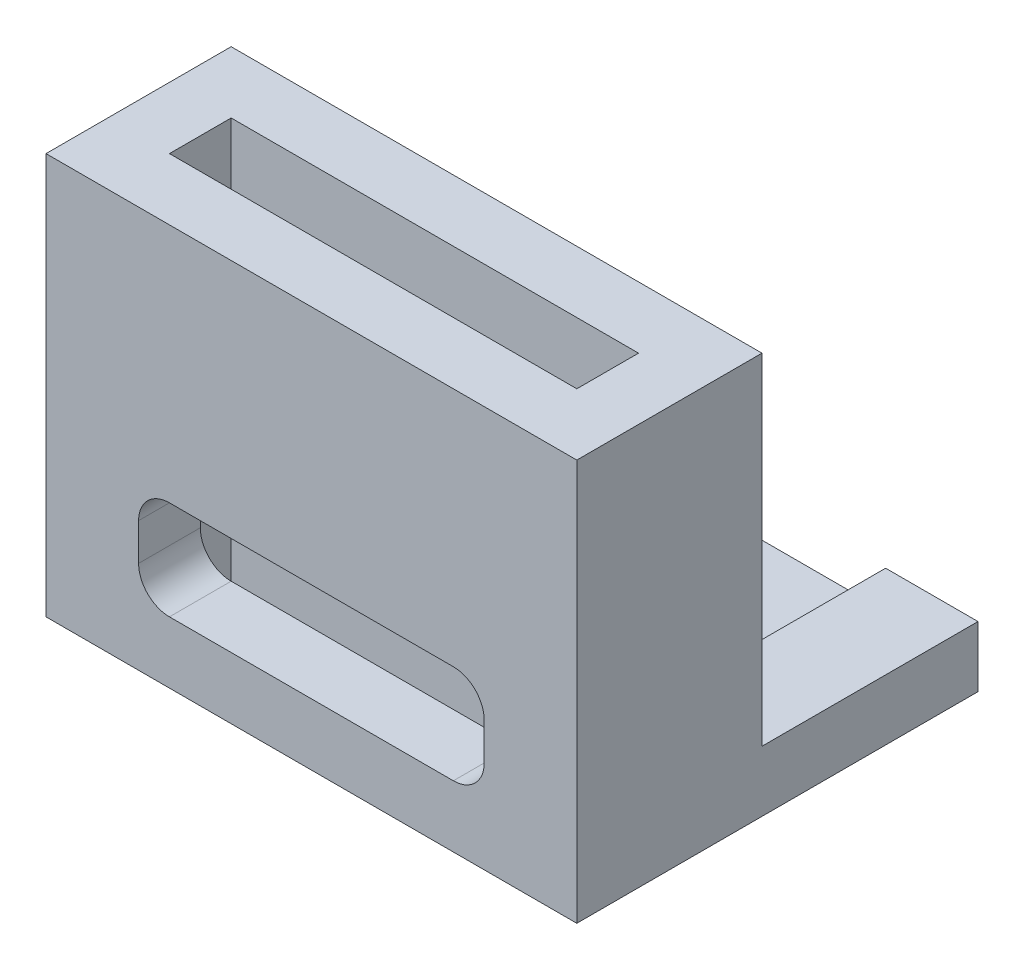
ISO-10303-21;
HEADER;
FILE_DESCRIPTION(('STEP AP214'),'2;1');
FILE_NAME('part.step','',(''),(''),'','','');
FILE_SCHEMA(('AUTOMOTIVE_DESIGN { 1 0 10303 214 1 1 1 1 }'));
ENDSEC;
DATA;
#1=APPLICATION_CONTEXT('core data for automotive mechanical design processes');
#2=APPLICATION_PROTOCOL_DEFINITION('international standard','automotive_design',2000,#1);
#3=PRODUCT_CONTEXT('',#1,'mechanical');
#4=PRODUCT('Part','Part','',(#3));
#5=PRODUCT_RELATED_PRODUCT_CATEGORY('part','',(#4));
#6=PRODUCT_DEFINITION_FORMATION('','',#4);
#7=PRODUCT_DEFINITION_CONTEXT('part definition',#1,'design');
#8=PRODUCT_DEFINITION('design','',#6,#7);
#9=PRODUCT_DEFINITION_SHAPE('','',#8);
#10=(LENGTH_UNIT() NAMED_UNIT(*) SI_UNIT(.MILLI.,.METRE.));
#11=(NAMED_UNIT(*) PLANE_ANGLE_UNIT() SI_UNIT($,.RADIAN.));
#12=(NAMED_UNIT(*) SI_UNIT($,.STERADIAN.) SOLID_ANGLE_UNIT());
#13=UNCERTAINTY_MEASURE_WITH_UNIT(LENGTH_MEASURE(1.E-05),#10,'distance_accuracy_value','');
#14=(GEOMETRIC_REPRESENTATION_CONTEXT(3) GLOBAL_UNCERTAINTY_ASSIGNED_CONTEXT((#13)) GLOBAL_UNIT_ASSIGNED_CONTEXT((#10,
#11,#12)) REPRESENTATION_CONTEXT('',''));
#15=CARTESIAN_POINT('',(0.,0.,0.));
#16=DIRECTION('',(0.,0.,1.));
#17=DIRECTION('',(1.,0.,0.));
#18=AXIS2_PLACEMENT_3D('',#15,#16,#17);
#19=CARTESIAN_POINT('',(15.2,1.96895504732383,-11.));
#20=DIRECTION('',(0.,-1.,0.));
#21=DIRECTION('',(0.,0.,-1.));
#22=AXIS2_PLACEMENT_3D('',#19,#20,#21);
#23=PLANE('',#22);
#24=DIRECTION('',(1.,0.,0.));
#25=VECTOR('',#24,1.);
#26=CARTESIAN_POINT('',(15.2,1.96895504732383,-4.));
#27=LINE('',#26,#25);
#28=CARTESIAN_POINT('',(-2.,1.96895504732383,-4.));
#29=VERTEX_POINT('',#28);
#30=CARTESIAN_POINT('',(1.,1.96895504732383,-4.));
#31=VERTEX_POINT('',#30);
#32=EDGE_CURVE('E55',#29,#31,#27,.T.);
#33=ORIENTED_EDGE('',*,*,#32,.T.);
#34=DIRECTION('',(0.,0.,-1.));
#35=VECTOR('',#34,1.);
#36=CARTESIAN_POINT('',(1.,1.96895504732383,-11.));
#37=LINE('',#36,#35);
#38=CARTESIAN_POINT('',(1.,1.96895504732383,-11.));
#39=VERTEX_POINT('',#38);
#40=EDGE_CURVE('E235',#31,#39,#37,.T.);
#41=ORIENTED_EDGE('',*,*,#40,.T.);
#42=DIRECTION('',(1.,0.,0.));
#43=VECTOR('',#42,1.);
#44=CARTESIAN_POINT('',(15.2,1.96895504732383,-11.));
#45=LINE('',#44,#43);
#46=CARTESIAN_POINT('',(-2.,1.96895504732383,-11.));
#47=VERTEX_POINT('',#46);
#48=EDGE_CURVE('E276',#47,#39,#45,.T.);
#49=ORIENTED_EDGE('',*,*,#48,.F.);
#50=DIRECTION('',(0.,0.,1.));
#51=VECTOR('',#50,1.);
#52=CARTESIAN_POINT('',(-2.,1.96895504732383,-11.));
#53=LINE('',#52,#51);
#54=EDGE_CURVE('E283',#47,#29,#53,.T.);
#55=ORIENTED_EDGE('',*,*,#54,.T.);
#56=EDGE_LOOP('',(#33,#41,#49,#55));
#57=FACE_BOUND('',#56,.T.);
#58=ADVANCED_FACE('F33',(#57),#23,.F.);
#59=CARTESIAN_POINT('',(-2.,13.,-4.));
#60=DIRECTION('',(0.,0.,1.));
#61=DIRECTION('',(1.,0.,0.));
#62=AXIS2_PLACEMENT_3D('',#59,#60,#61);
#63=PLANE('',#62);
#64=DIRECTION('',(0.,1.,0.));
#65=VECTOR('',#64,1.);
#66=CARTESIAN_POINT('',(1.,0.752448814893286,-4.));
#67=LINE('',#66,#65);
#68=CARTESIAN_POINT('',(1.,0.752448814893286,-4.));
#69=VERTEX_POINT('',#68);
#70=EDGE_CURVE('E229',#69,#31,#67,.T.);
#71=ORIENTED_EDGE('',*,*,#70,.T.);
#72=ORIENTED_EDGE('',*,*,#32,.F.);
#73=DIRECTION('',(0.,-1.,0.));
#74=VECTOR('',#73,1.);
#75=CARTESIAN_POINT('',(-2.,13.,-4.));
#76=LINE('',#75,#74);
#77=CARTESIAN_POINT('',(-2.,13.,-4.));
#78=VERTEX_POINT('',#77);
#79=EDGE_CURVE('E428',#78,#29,#76,.T.);
#80=ORIENTED_EDGE('',*,*,#79,.F.);
#81=DIRECTION('',(-1.,0.,0.));
#82=VECTOR('',#81,1.);
#83=CARTESIAN_POINT('',(-2.,13.,-4.));
#84=LINE('',#83,#82);
#85=CARTESIAN_POINT('',(15.2,13.,-4.));
#86=VERTEX_POINT('',#85);
#87=EDGE_CURVE('E405',#86,#78,#84,.T.);
#88=ORIENTED_EDGE('',*,*,#87,.F.);
#89=DIRECTION('',(0.,-1.,0.));
#90=VECTOR('',#89,1.);
#91=CARTESIAN_POINT('',(15.2,13.,-4.));
#92=LINE('',#91,#90);
#93=CARTESIAN_POINT('',(15.2,1.96895504732383,-4.));
#94=VERTEX_POINT('',#93);
#95=EDGE_CURVE('E415',#86,#94,#92,.T.);
#96=ORIENTED_EDGE('',*,*,#95,.T.);
#97=CARTESIAN_POINT('',(12.2065069842452,1.96895504732383,-4.));
#98=VERTEX_POINT('',#97);
#99=EDGE_CURVE('E266',#98,#94,#27,.T.);
#100=ORIENTED_EDGE('',*,*,#99,.F.);
#101=DIRECTION('',(0.,-1.,0.));
#102=VECTOR('',#101,1.);
#103=CARTESIAN_POINT('',(12.2065069842452,0.752448814893286,-4.));
#104=LINE('',#103,#102);
#105=CARTESIAN_POINT('',(12.2065069842452,0.752448814893286,-4.));
#106=VERTEX_POINT('',#105);
#107=EDGE_CURVE('E237',#98,#106,#104,.T.);
#108=ORIENTED_EDGE('',*,*,#107,.T.);
#109=DIRECTION('',(-1.,0.,0.));
#110=VECTOR('',#109,1.);
#111=CARTESIAN_POINT('',(12.2065069842452,0.752448814893286,-4.));
#112=LINE('',#111,#110);
#113=EDGE_CURVE('E244',#106,#69,#112,.T.);
#114=ORIENTED_EDGE('',*,*,#113,.T.);
#115=EDGE_LOOP('',(#71,#72,#80,#88,#96,#100,#108,#114));
#116=FACE_BOUND('',#115,.T.);
#117=DIRECTION('',(0.,1.,0.));
#118=VECTOR('',#117,1.);
#119=CARTESIAN_POINT('',(12.2,13.,-4.));
#120=LINE('',#119,#118);
#121=CARTESIAN_POINT('',(12.2,3.,-4.));
#122=VERTEX_POINT('',#121);
#123=CARTESIAN_POINT('',(12.2,4.2,-4.));
#124=VERTEX_POINT('',#123);
#125=EDGE_CURVE('E356',#122,#124,#120,.T.);
#126=ORIENTED_EDGE('',*,*,#125,.T.);
#127=CARTESIAN_POINT('',(11.2,4.2,-4.));
#128=DIRECTION('',(0.,0.,1.));
#129=DIRECTION('',(1.,0.,0.));
#130=AXIS2_PLACEMENT_3D('',#127,#128,#129);
#131=CIRCLE('',#130,1.);
#132=CARTESIAN_POINT('',(11.2,5.2,-4.));
#133=VERTEX_POINT('',#132);
#134=EDGE_CURVE('E360',#124,#133,#131,.T.);
#135=ORIENTED_EDGE('',*,*,#134,.T.);
#136=DIRECTION('',(1.,0.,0.));
#137=VECTOR('',#136,1.);
#138=CARTESIAN_POINT('',(-2.,5.2,-4.));
#139=LINE('',#138,#137);
#140=CARTESIAN_POINT('',(2.,5.2,-4.));
#141=VERTEX_POINT('',#140);
#142=EDGE_CURVE('E366',#141,#133,#139,.T.);
#143=ORIENTED_EDGE('',*,*,#142,.F.);
#144=CARTESIAN_POINT('',(2.,4.2,-4.));
#145=DIRECTION('',(0.,0.,1.));
#146=DIRECTION('',(1.,0.,0.));
#147=AXIS2_PLACEMENT_3D('',#144,#145,#146);
#148=CIRCLE('',#147,1.);
#149=CARTESIAN_POINT('',(1.,4.2,-4.));
#150=VERTEX_POINT('',#149);
#151=EDGE_CURVE('E370',#141,#150,#148,.T.);
#152=ORIENTED_EDGE('',*,*,#151,.T.);
#153=DIRECTION('',(0.,-1.,0.));
#154=VECTOR('',#153,1.);
#155=CARTESIAN_POINT('',(1.,13.,-4.));
#156=LINE('',#155,#154);
#157=CARTESIAN_POINT('',(1.,3.,-4.));
#158=VERTEX_POINT('',#157);
#159=EDGE_CURVE('E336',#150,#158,#156,.T.);
#160=ORIENTED_EDGE('',*,*,#159,.T.);
#161=CARTESIAN_POINT('',(2.,3.,-4.));
#162=DIRECTION('',(0.,0.,1.));
#163=DIRECTION('',(1.,0.,0.));
#164=AXIS2_PLACEMENT_3D('',#161,#162,#163);
#165=CIRCLE('',#164,1.);
#166=CARTESIAN_POINT('',(2.,2.,-4.));
#167=VERTEX_POINT('',#166);
#168=EDGE_CURVE('E341',#158,#167,#165,.T.);
#169=ORIENTED_EDGE('',*,*,#168,.T.);
#170=DIRECTION('',(1.,0.,0.));
#171=VECTOR('',#170,1.);
#172=CARTESIAN_POINT('',(-2.,2.,-4.));
#173=LINE('',#172,#171);
#174=CARTESIAN_POINT('',(11.2,2.,-4.));
#175=VERTEX_POINT('',#174);
#176=EDGE_CURVE('E346',#167,#175,#173,.T.);
#177=ORIENTED_EDGE('',*,*,#176,.T.);
#178=CARTESIAN_POINT('',(11.2,3.,-4.));
#179=DIRECTION('',(0.,0.,1.));
#180=DIRECTION('',(1.,0.,0.));
#181=AXIS2_PLACEMENT_3D('',#178,#179,#180);
#182=CIRCLE('',#181,1.);
#183=EDGE_CURVE('E351',#175,#122,#182,.T.);
#184=ORIENTED_EDGE('',*,*,#183,.T.);
#185=EDGE_LOOP('',(#126,#135,#143,#152,#160,#169,#177,#184));
#186=FACE_BOUND('',#185,.T.);
#187=ADVANCED_FACE('F35',(#116,#186),#63,.F.);
#188=CARTESIAN_POINT('',(0.,13.,0.));
#189=DIRECTION('',(0.,-1.,0.));
#190=DIRECTION('',(0.,0.,-1.));
#191=AXIS2_PLACEMENT_3D('',#188,#189,#190);
#192=PLANE('',#191);
#193=ORIENTED_EDGE('',*,*,#87,.T.);
#194=DIRECTION('',(0.,0.,1.));
#195=VECTOR('',#194,1.);
#196=CARTESIAN_POINT('',(-2.,13.,2.));
#197=LINE('',#196,#195);
#198=CARTESIAN_POINT('',(-2.,13.,2.));
#199=VERTEX_POINT('',#198);
#200=EDGE_CURVE('E408',#78,#199,#197,.T.);
#201=ORIENTED_EDGE('',*,*,#200,.T.);
#202=DIRECTION('',(1.,0.,0.));
#203=VECTOR('',#202,1.);
#204=CARTESIAN_POINT('',(-2.,13.,2.));
#205=LINE('',#204,#203);
#206=CARTESIAN_POINT('',(15.2,13.,2.));
#207=VERTEX_POINT('',#206);
#208=EDGE_CURVE('E411',#199,#207,#205,.T.);
#209=ORIENTED_EDGE('',*,*,#208,.T.);
#210=DIRECTION('',(0.,0.,-1.));
#211=VECTOR('',#210,1.);
#212=CARTESIAN_POINT('',(15.2,13.,-4.));
#213=LINE('',#212,#211);
#214=EDGE_CURVE('E413',#207,#86,#213,.T.);
#215=ORIENTED_EDGE('',*,*,#214,.T.);
#216=EDGE_LOOP('',(#193,#201,#209,#215));
#217=FACE_BOUND('',#216,.T.);
#218=DIRECTION('',(0.,0.,1.));
#219=VECTOR('',#218,1.);
#220=CARTESIAN_POINT('',(0.,13.,0.));
#221=LINE('',#220,#219);
#222=CARTESIAN_POINT('',(0.,13.,-2.));
#223=VERTEX_POINT('',#222);
#224=CARTESIAN_POINT('',(0.,13.,0.));
#225=VERTEX_POINT('',#224);
#226=EDGE_CURVE('E374',#223,#225,#221,.T.);
#227=ORIENTED_EDGE('',*,*,#226,.F.);
#228=DIRECTION('',(-1.,0.,0.));
#229=VECTOR('',#228,1.);
#230=CARTESIAN_POINT('',(0.,13.,-2.));
#231=LINE('',#230,#229);
#232=CARTESIAN_POINT('',(13.2,13.,-2.));
#233=VERTEX_POINT('',#232);
#234=EDGE_CURVE('E382',#233,#223,#231,.T.);
#235=ORIENTED_EDGE('',*,*,#234,.F.);
#236=DIRECTION('',(0.,0.,-1.));
#237=VECTOR('',#236,1.);
#238=CARTESIAN_POINT('',(13.2,13.,-2.));
#239=LINE('',#238,#237);
#240=CARTESIAN_POINT('',(13.2,13.,0.));
#241=VERTEX_POINT('',#240);
#242=EDGE_CURVE('E379',#241,#233,#239,.T.);
#243=ORIENTED_EDGE('',*,*,#242,.F.);
#244=DIRECTION('',(1.,0.,0.));
#245=VECTOR('',#244,1.);
#246=CARTESIAN_POINT('',(0.,13.,0.));
#247=LINE('',#246,#245);
#248=EDGE_CURVE('E376',#225,#241,#247,.T.);
#249=ORIENTED_EDGE('',*,*,#248,.F.);
#250=EDGE_LOOP('',(#227,#235,#243,#249));
#251=FACE_BOUND('',#250,.T.);
#252=ADVANCED_FACE('F467',(#217,#251),#192,.F.);
#253=CARTESIAN_POINT('',(0.,0.,0.));
#254=DIRECTION('',(0.,-1.,0.));
#255=DIRECTION('',(0.,0.,-1.));
#256=AXIS2_PLACEMENT_3D('',#253,#254,#255);
#257=PLANE('',#256);
#258=CARTESIAN_POINT('',(6.6,0.,-7.5));
#259=DIRECTION('',(0.,-1.,0.));
#260=DIRECTION('',(0.,0.,-1.));
#261=AXIS2_PLACEMENT_3D('',#258,#259,#260);
#262=CIRCLE('',#261,1.6);
#263=CARTESIAN_POINT('',(6.6,0.,-9.1));
#264=VERTEX_POINT('',#263);
#265=EDGE_CURVE('E263',#264,#264,#262,.T.);
#266=ORIENTED_EDGE('',*,*,#265,.F.);
#267=EDGE_LOOP('',(#266));
#268=FACE_BOUND('',#267,.T.);
#269=DIRECTION('',(0.,0.,1.));
#270=VECTOR('',#269,1.);
#271=CARTESIAN_POINT('',(-2.,0.,2.));
#272=LINE('',#271,#270);
#273=CARTESIAN_POINT('',(-2.,0.,-11.));
#274=VERTEX_POINT('',#273);
#275=CARTESIAN_POINT('',(-2.,0.,2.));
#276=VERTEX_POINT('',#275);
#277=EDGE_CURVE('E404',#274,#276,#272,.T.);
#278=ORIENTED_EDGE('',*,*,#277,.F.);
#279=DIRECTION('',(-1.,0.,0.));
#280=VECTOR('',#279,1.);
#281=CARTESIAN_POINT('',(15.2,0.,-11.));
#282=LINE('',#281,#280);
#283=CARTESIAN_POINT('',(15.2,0.,-11.));
#284=VERTEX_POINT('',#283);
#285=EDGE_CURVE('E270',#284,#274,#282,.T.);
#286=ORIENTED_EDGE('',*,*,#285,.F.);
#287=DIRECTION('',(0.,0.,-1.));
#288=VECTOR('',#287,1.);
#289=CARTESIAN_POINT('',(15.2,0.,-4.));
#290=LINE('',#289,#288);
#291=CARTESIAN_POINT('',(15.2,0.,2.));
#292=VERTEX_POINT('',#291);
#293=EDGE_CURVE('E409',#292,#284,#290,.T.);
#294=ORIENTED_EDGE('',*,*,#293,.F.);
#295=DIRECTION('',(1.,0.,0.));
#296=VECTOR('',#295,1.);
#297=CARTESIAN_POINT('',(-2.,0.,2.));
#298=LINE('',#297,#296);
#299=EDGE_CURVE('E417',#276,#292,#298,.T.);
#300=ORIENTED_EDGE('',*,*,#299,.F.);
#301=EDGE_LOOP('',(#278,#286,#294,#300));
#302=FACE_BOUND('',#301,.T.);
#303=DIRECTION('',(-1.,0.,0.));
#304=VECTOR('',#303,1.);
#305=CARTESIAN_POINT('',(0.,0.,-2.));
#306=LINE('',#305,#304);
#307=CARTESIAN_POINT('',(13.2,0.,-2.));
#308=VERTEX_POINT('',#307);
#309=CARTESIAN_POINT('',(0.,0.,-2.));
#310=VERTEX_POINT('',#309);
#311=EDGE_CURVE('E377',#308,#310,#306,.T.);
#312=ORIENTED_EDGE('',*,*,#311,.T.);
#313=DIRECTION('',(0.,0.,1.));
#314=VECTOR('',#313,1.);
#315=CARTESIAN_POINT('',(0.,0.,0.));
#316=LINE('',#315,#314);
#317=CARTESIAN_POINT('',(0.,0.,0.));
#318=VERTEX_POINT('',#317);
#319=EDGE_CURVE('E373',#310,#318,#316,.T.);
#320=ORIENTED_EDGE('',*,*,#319,.T.);
#321=DIRECTION('',(1.,0.,0.));
#322=VECTOR('',#321,1.);
#323=CARTESIAN_POINT('',(0.,0.,0.));
#324=LINE('',#323,#322);
#325=CARTESIAN_POINT('',(13.2,0.,0.));
#326=VERTEX_POINT('',#325);
#327=EDGE_CURVE('E387',#318,#326,#324,.T.);
#328=ORIENTED_EDGE('',*,*,#327,.T.);
#329=DIRECTION('',(0.,0.,-1.));
#330=VECTOR('',#329,1.);
#331=CARTESIAN_POINT('',(13.2,0.,-2.));
#332=LINE('',#331,#330);
#333=EDGE_CURVE('E390',#326,#308,#332,.T.);
#334=ORIENTED_EDGE('',*,*,#333,.T.);
#335=EDGE_LOOP('',(#312,#320,#328,#334));
#336=FACE_BOUND('',#335,.T.);
#337=ADVANCED_FACE('F505',(#268,#302,#336),#257,.T.);
#338=CARTESIAN_POINT('',(-2.,13.,2.));
#339=DIRECTION('',(1.,0.,0.));
#340=DIRECTION('',(0.,0.,-1.));
#341=AXIS2_PLACEMENT_3D('',#338,#339,#340);
#342=PLANE('',#341);
#343=ORIENTED_EDGE('',*,*,#277,.T.);
#344=DIRECTION('',(0.,-1.,0.));
#345=VECTOR('',#344,1.);
#346=CARTESIAN_POINT('',(-2.,13.,2.));
#347=LINE('',#346,#345);
#348=EDGE_CURVE('E425',#199,#276,#347,.T.);
#349=ORIENTED_EDGE('',*,*,#348,.F.);
#350=ORIENTED_EDGE('',*,*,#200,.F.);
#351=ORIENTED_EDGE('',*,*,#79,.T.);
#352=ORIENTED_EDGE('',*,*,#54,.F.);
#353=DIRECTION('',(0.,1.,0.));
#354=VECTOR('',#353,1.);
#355=CARTESIAN_POINT('',(-2.,0.,-11.));
#356=LINE('',#355,#354);
#357=EDGE_CURVE('E273',#274,#47,#356,.T.);
#358=ORIENTED_EDGE('',*,*,#357,.F.);
#359=EDGE_LOOP('',(#343,#349,#350,#351,#352,#358));
#360=FACE_BOUND('',#359,.T.);
#361=ADVANCED_FACE('F490',(#360),#342,.F.);
#362=CARTESIAN_POINT('',(-2.,13.,2.));
#363=DIRECTION('',(0.,0.,-1.));
#364=DIRECTION('',(-1.,0.,0.));
#365=AXIS2_PLACEMENT_3D('',#362,#363,#364);
#366=PLANE('',#365);
#367=DIRECTION('',(0.,-1.,0.));
#368=VECTOR('',#367,1.);
#369=CARTESIAN_POINT('',(1.,4.2,2.));
#370=LINE('',#369,#368);
#371=CARTESIAN_POINT('',(1.,4.2,2.));
#372=VERTEX_POINT('',#371);
#373=CARTESIAN_POINT('',(1.,3.,2.));
#374=VERTEX_POINT('',#373);
#375=EDGE_CURVE('E288',#372,#374,#370,.T.);
#376=ORIENTED_EDGE('',*,*,#375,.F.);
#377=CARTESIAN_POINT('',(2.,4.2,2.));
#378=DIRECTION('',(0.,0.,1.));
#379=DIRECTION('',(1.,0.,0.));
#380=AXIS2_PLACEMENT_3D('',#377,#378,#379);
#381=CIRCLE('',#380,1.);
#382=CARTESIAN_POINT('',(2.,5.2,2.));
#383=VERTEX_POINT('',#382);
#384=EDGE_CURVE('E286',#383,#372,#381,.T.);
#385=ORIENTED_EDGE('',*,*,#384,.F.);
#386=DIRECTION('',(1.,0.,0.));
#387=VECTOR('',#386,1.);
#388=CARTESIAN_POINT('',(2.,5.2,2.));
#389=LINE('',#388,#387);
#390=CARTESIAN_POINT('',(11.2,5.2,2.));
#391=VERTEX_POINT('',#390);
#392=EDGE_CURVE('E306',#383,#391,#389,.T.);
#393=ORIENTED_EDGE('',*,*,#392,.T.);
#394=CARTESIAN_POINT('',(11.2,4.2,2.));
#395=DIRECTION('',(0.,0.,1.));
#396=DIRECTION('',(1.,0.,0.));
#397=AXIS2_PLACEMENT_3D('',#394,#395,#396);
#398=CIRCLE('',#397,1.);
#399=CARTESIAN_POINT('',(12.2,4.2,2.));
#400=VERTEX_POINT('',#399);
#401=EDGE_CURVE('E303',#400,#391,#398,.T.);
#402=ORIENTED_EDGE('',*,*,#401,.F.);
#403=DIRECTION('',(0.,1.,0.));
#404=VECTOR('',#403,1.);
#405=CARTESIAN_POINT('',(12.2,3.,2.));
#406=LINE('',#405,#404);
#407=CARTESIAN_POINT('',(12.2,3.,2.));
#408=VERTEX_POINT('',#407);
#409=EDGE_CURVE('E300',#408,#400,#406,.T.);
#410=ORIENTED_EDGE('',*,*,#409,.F.);
#411=CARTESIAN_POINT('',(11.2,3.,2.));
#412=DIRECTION('',(0.,0.,1.));
#413=DIRECTION('',(1.,0.,0.));
#414=AXIS2_PLACEMENT_3D('',#411,#412,#413);
#415=CIRCLE('',#414,1.);
#416=CARTESIAN_POINT('',(11.2,2.,2.));
#417=VERTEX_POINT('',#416);
#418=EDGE_CURVE('E297',#417,#408,#415,.T.);
#419=ORIENTED_EDGE('',*,*,#418,.F.);
#420=DIRECTION('',(1.,0.,0.));
#421=VECTOR('',#420,1.);
#422=CARTESIAN_POINT('',(2.,2.,2.));
#423=LINE('',#422,#421);
#424=CARTESIAN_POINT('',(2.,2.,2.));
#425=VERTEX_POINT('',#424);
#426=EDGE_CURVE('E294',#425,#417,#423,.T.);
#427=ORIENTED_EDGE('',*,*,#426,.F.);
#428=CARTESIAN_POINT('',(2.,3.,2.));
#429=DIRECTION('',(0.,0.,1.));
#430=DIRECTION('',(1.,0.,0.));
#431=AXIS2_PLACEMENT_3D('',#428,#429,#430);
#432=CIRCLE('',#431,1.);
#433=EDGE_CURVE('E291',#374,#425,#432,.T.);
#434=ORIENTED_EDGE('',*,*,#433,.F.);
#435=EDGE_LOOP('',(#376,#385,#393,#402,#410,#419,#427,#434));
#436=FACE_BOUND('',#435,.T.);
#437=ORIENTED_EDGE('',*,*,#299,.T.);
#438=DIRECTION('',(0.,-1.,0.));
#439=VECTOR('',#438,1.);
#440=CARTESIAN_POINT('',(15.2,13.,2.));
#441=LINE('',#440,#439);
#442=EDGE_CURVE('E422',#207,#292,#441,.T.);
#443=ORIENTED_EDGE('',*,*,#442,.F.);
#444=ORIENTED_EDGE('',*,*,#208,.F.);
#445=ORIENTED_EDGE('',*,*,#348,.T.);
#446=EDGE_LOOP('',(#437,#443,#444,#445));
#447=FACE_BOUND('',#446,.T.);
#448=ADVANCED_FACE('F508',(#436,#447),#366,.F.);
#449=CARTESIAN_POINT('',(15.2,13.,-4.));
#450=DIRECTION('',(-1.,0.,0.));
#451=DIRECTION('',(0.,0.,1.));
#452=AXIS2_PLACEMENT_3D('',#449,#450,#451);
#453=PLANE('',#452);
#454=ORIENTED_EDGE('',*,*,#293,.T.);
#455=DIRECTION('',(0.,-1.,0.));
#456=VECTOR('',#455,1.);
#457=CARTESIAN_POINT('',(15.2,0.,-11.));
#458=LINE('',#457,#456);
#459=CARTESIAN_POINT('',(15.2,1.96895504732383,-11.));
#460=VERTEX_POINT('',#459);
#461=EDGE_CURVE('E267',#460,#284,#458,.T.);
#462=ORIENTED_EDGE('',*,*,#461,.F.);
#463=DIRECTION('',(0.,0.,1.));
#464=VECTOR('',#463,1.);
#465=CARTESIAN_POINT('',(15.2,1.96895504732383,-11.));
#466=LINE('',#465,#464);
#467=EDGE_CURVE('E279',#460,#94,#466,.T.);
#468=ORIENTED_EDGE('',*,*,#467,.T.);
#469=ORIENTED_EDGE('',*,*,#95,.F.);
#470=ORIENTED_EDGE('',*,*,#214,.F.);
#471=ORIENTED_EDGE('',*,*,#442,.T.);
#472=EDGE_LOOP('',(#454,#462,#468,#469,#470,#471));
#473=FACE_BOUND('',#472,.T.);
#474=ADVANCED_FACE('F500',(#473),#453,.F.);
#475=CARTESIAN_POINT('',(0.,13.,0.));
#476=DIRECTION('',(1.,0.,0.));
#477=DIRECTION('',(0.,0.,-1.));
#478=AXIS2_PLACEMENT_3D('',#475,#476,#477);
#479=PLANE('',#478);
#480=ORIENTED_EDGE('',*,*,#319,.F.);
#481=DIRECTION('',(0.,-1.,0.));
#482=VECTOR('',#481,1.);
#483=CARTESIAN_POINT('',(0.,13.,-2.));
#484=LINE('',#483,#482);
#485=EDGE_CURVE('E384',#223,#310,#484,.T.);
#486=ORIENTED_EDGE('',*,*,#485,.F.);
#487=ORIENTED_EDGE('',*,*,#226,.T.);
#488=DIRECTION('',(0.,-1.,0.));
#489=VECTOR('',#488,1.);
#490=CARTESIAN_POINT('',(0.,13.,0.));
#491=LINE('',#490,#489);
#492=EDGE_CURVE('E401',#225,#318,#491,.T.);
#493=ORIENTED_EDGE('',*,*,#492,.T.);
#494=EDGE_LOOP('',(#480,#486,#487,#493));
#495=FACE_BOUND('',#494,.T.);
#496=ADVANCED_FACE('F516',(#495),#479,.T.);
#497=CARTESIAN_POINT('',(0.,13.,0.));
#498=DIRECTION('',(0.,0.,-1.));
#499=DIRECTION('',(-1.,0.,0.));
#500=AXIS2_PLACEMENT_3D('',#497,#498,#499);
#501=PLANE('',#500);
#502=CARTESIAN_POINT('',(2.,4.2,0.));
#503=DIRECTION('',(0.,0.,-1.));
#504=DIRECTION('',(-1.,0.,0.));
#505=AXIS2_PLACEMENT_3D('',#502,#503,#504);
#506=CIRCLE('',#505,1.);
#507=CARTESIAN_POINT('',(1.,4.2,0.));
#508=VERTEX_POINT('',#507);
#509=CARTESIAN_POINT('',(2.,5.2,0.));
#510=VERTEX_POINT('',#509);
#511=EDGE_CURVE('E368',#508,#510,#506,.T.);
#512=ORIENTED_EDGE('',*,*,#511,.F.);
#513=DIRECTION('',(0.,1.,0.));
#514=VECTOR('',#513,1.);
#515=CARTESIAN_POINT('',(1.,13.,0.));
#516=LINE('',#515,#514);
#517=CARTESIAN_POINT('',(1.,3.,0.));
#518=VERTEX_POINT('',#517);
#519=EDGE_CURVE('E334',#518,#508,#516,.T.);
#520=ORIENTED_EDGE('',*,*,#519,.F.);
#521=CARTESIAN_POINT('',(2.,3.,0.));
#522=DIRECTION('',(0.,0.,-1.));
#523=DIRECTION('',(-1.,0.,0.));
#524=AXIS2_PLACEMENT_3D('',#521,#522,#523);
#525=CIRCLE('',#524,1.);
#526=CARTESIAN_POINT('',(2.,2.,0.));
#527=VERTEX_POINT('',#526);
#528=EDGE_CURVE('E338',#527,#518,#525,.T.);
#529=ORIENTED_EDGE('',*,*,#528,.F.);
#530=DIRECTION('',(-1.,0.,0.));
#531=VECTOR('',#530,1.);
#532=CARTESIAN_POINT('',(0.,2.,0.));
#533=LINE('',#532,#531);
#534=CARTESIAN_POINT('',(11.2,2.,0.));
#535=VERTEX_POINT('',#534);
#536=EDGE_CURVE('E344',#535,#527,#533,.T.);
#537=ORIENTED_EDGE('',*,*,#536,.F.);
#538=CARTESIAN_POINT('',(11.2,3.,0.));
#539=DIRECTION('',(0.,0.,-1.));
#540=DIRECTION('',(-1.,0.,0.));
#541=AXIS2_PLACEMENT_3D('',#538,#539,#540);
#542=CIRCLE('',#541,1.);
#543=CARTESIAN_POINT('',(12.2,3.,0.));
#544=VERTEX_POINT('',#543);
#545=EDGE_CURVE('E349',#544,#535,#542,.T.);
#546=ORIENTED_EDGE('',*,*,#545,.F.);
#547=DIRECTION('',(0.,-1.,0.));
#548=VECTOR('',#547,1.);
#549=CARTESIAN_POINT('',(12.2,13.,0.));
#550=LINE('',#549,#548);
#551=CARTESIAN_POINT('',(12.2,4.2,0.));
#552=VERTEX_POINT('',#551);
#553=EDGE_CURVE('E354',#552,#544,#550,.T.);
#554=ORIENTED_EDGE('',*,*,#553,.F.);
#555=CARTESIAN_POINT('',(11.2,4.2,0.));
#556=DIRECTION('',(0.,0.,-1.));
#557=DIRECTION('',(-1.,0.,0.));
#558=AXIS2_PLACEMENT_3D('',#555,#556,#557);
#559=CIRCLE('',#558,1.);
#560=CARTESIAN_POINT('',(11.2,5.2,0.));
#561=VERTEX_POINT('',#560);
#562=EDGE_CURVE('E358',#561,#552,#559,.T.);
#563=ORIENTED_EDGE('',*,*,#562,.F.);
#564=DIRECTION('',(-1.,0.,0.));
#565=VECTOR('',#564,1.);
#566=CARTESIAN_POINT('',(0.,5.2,0.));
#567=LINE('',#566,#565);
#568=EDGE_CURVE('E363',#561,#510,#567,.T.);
#569=ORIENTED_EDGE('',*,*,#568,.T.);
#570=EDGE_LOOP('',(#512,#520,#529,#537,#546,#554,#563,#569));
#571=FACE_BOUND('',#570,.T.);
#572=ORIENTED_EDGE('',*,*,#327,.F.);
#573=ORIENTED_EDGE('',*,*,#492,.F.);
#574=ORIENTED_EDGE('',*,*,#248,.T.);
#575=DIRECTION('',(0.,-1.,0.));
#576=VECTOR('',#575,1.);
#577=CARTESIAN_POINT('',(13.2,13.,0.));
#578=LINE('',#577,#576);
#579=EDGE_CURVE('E399',#241,#326,#578,.T.);
#580=ORIENTED_EDGE('',*,*,#579,.T.);
#581=EDGE_LOOP('',(#572,#573,#574,#580));
#582=FACE_BOUND('',#581,.T.);
#583=ADVANCED_FACE('F527',(#571,#582),#501,.T.);
#584=CARTESIAN_POINT('',(13.2,13.,-2.));
#585=DIRECTION('',(-1.,0.,0.));
#586=DIRECTION('',(0.,0.,1.));
#587=AXIS2_PLACEMENT_3D('',#584,#585,#586);
#588=PLANE('',#587);
#589=ORIENTED_EDGE('',*,*,#333,.F.);
#590=ORIENTED_EDGE('',*,*,#579,.F.);
#591=ORIENTED_EDGE('',*,*,#242,.T.);
#592=DIRECTION('',(0.,-1.,0.));
#593=VECTOR('',#592,1.);
#594=CARTESIAN_POINT('',(13.2,13.,-2.));
#595=LINE('',#594,#593);
#596=EDGE_CURVE('E397',#233,#308,#595,.T.);
#597=ORIENTED_EDGE('',*,*,#596,.T.);
#598=EDGE_LOOP('',(#589,#590,#591,#597));
#599=FACE_BOUND('',#598,.T.);
#600=ADVANCED_FACE('F531',(#599),#588,.T.);
#601=CARTESIAN_POINT('',(0.,13.,-2.));
#602=DIRECTION('',(0.,0.,1.));
#603=DIRECTION('',(1.,0.,0.));
#604=AXIS2_PLACEMENT_3D('',#601,#602,#603);
#605=PLANE('',#604);
#606=CARTESIAN_POINT('',(2.,4.2,-2.));
#607=DIRECTION('',(0.,0.,1.));
#608=DIRECTION('',(1.,0.,0.));
#609=AXIS2_PLACEMENT_3D('',#606,#607,#608);
#610=CIRCLE('',#609,1.);
#611=CARTESIAN_POINT('',(2.,5.2,-2.));
#612=VERTEX_POINT('',#611);
#613=CARTESIAN_POINT('',(1.,4.2,-2.));
#614=VERTEX_POINT('',#613);
#615=EDGE_CURVE('E41',#612,#614,#610,.T.);
#616=ORIENTED_EDGE('',*,*,#615,.F.);
#617=DIRECTION('',(1.,0.,0.));
#618=VECTOR('',#617,1.);
#619=CARTESIAN_POINT('',(0.,5.2,-2.));
#620=LINE('',#619,#618);
#621=CARTESIAN_POINT('',(11.2,5.2,-2.));
#622=VERTEX_POINT('',#621);
#623=EDGE_CURVE('E442',#612,#622,#620,.T.);
#624=ORIENTED_EDGE('',*,*,#623,.T.);
#625=CARTESIAN_POINT('',(11.2,4.2,-2.));
#626=DIRECTION('',(0.,0.,1.));
#627=DIRECTION('',(1.,0.,0.));
#628=AXIS2_PLACEMENT_3D('',#625,#626,#627);
#629=CIRCLE('',#628,1.);
#630=CARTESIAN_POINT('',(12.2,4.2,-2.));
#631=VERTEX_POINT('',#630);
#632=EDGE_CURVE('E440',#631,#622,#629,.T.);
#633=ORIENTED_EDGE('',*,*,#632,.F.);
#634=DIRECTION('',(0.,1.,0.));
#635=VECTOR('',#634,1.);
#636=CARTESIAN_POINT('',(12.2,13.,-2.));
#637=LINE('',#636,#635);
#638=CARTESIAN_POINT('',(12.2,3.,-2.));
#639=VERTEX_POINT('',#638);
#640=EDGE_CURVE('E438',#639,#631,#637,.T.);
#641=ORIENTED_EDGE('',*,*,#640,.F.);
#642=CARTESIAN_POINT('',(11.2,3.,-2.));
#643=DIRECTION('',(0.,0.,1.));
#644=DIRECTION('',(1.,0.,0.));
#645=AXIS2_PLACEMENT_3D('',#642,#643,#644);
#646=CIRCLE('',#645,1.);
#647=CARTESIAN_POINT('',(11.2,2.,-2.));
#648=VERTEX_POINT('',#647);
#649=EDGE_CURVE('E436',#648,#639,#646,.T.);
#650=ORIENTED_EDGE('',*,*,#649,.F.);
#651=DIRECTION('',(1.,0.,0.));
#652=VECTOR('',#651,1.);
#653=CARTESIAN_POINT('',(0.,2.,-2.));
#654=LINE('',#653,#652);
#655=CARTESIAN_POINT('',(2.,2.,-2.));
#656=VERTEX_POINT('',#655);
#657=EDGE_CURVE('E434',#656,#648,#654,.T.);
#658=ORIENTED_EDGE('',*,*,#657,.F.);
#659=CARTESIAN_POINT('',(2.,3.,-2.));
#660=DIRECTION('',(0.,0.,1.));
#661=DIRECTION('',(1.,0.,0.));
#662=AXIS2_PLACEMENT_3D('',#659,#660,#661);
#663=CIRCLE('',#662,1.);
#664=CARTESIAN_POINT('',(1.,3.,-2.));
#665=VERTEX_POINT('',#664);
#666=EDGE_CURVE('E432',#665,#656,#663,.T.);
#667=ORIENTED_EDGE('',*,*,#666,.F.);
#668=DIRECTION('',(0.,-1.,0.));
#669=VECTOR('',#668,1.);
#670=CARTESIAN_POINT('',(1.,13.,-2.));
#671=LINE('',#670,#669);
#672=EDGE_CURVE('E430',#614,#665,#671,.T.);
#673=ORIENTED_EDGE('',*,*,#672,.F.);
#674=EDGE_LOOP('',(#616,#624,#633,#641,#650,#658,#667,#673));
#675=FACE_BOUND('',#674,.T.);
#676=ORIENTED_EDGE('',*,*,#311,.F.);
#677=ORIENTED_EDGE('',*,*,#596,.F.);
#678=ORIENTED_EDGE('',*,*,#234,.T.);
#679=ORIENTED_EDGE('',*,*,#485,.T.);
#680=EDGE_LOOP('',(#676,#677,#678,#679));
#681=FACE_BOUND('',#680,.T.);
#682=ADVANCED_FACE('F535',(#675,#681),#605,.T.);
#683=CARTESIAN_POINT('',(1.,4.2,-11.));
#684=DIRECTION('',(-1.,0.,0.));
#685=DIRECTION('',(0.,-1.,0.));
#686=AXIS2_PLACEMENT_3D('',#683,#684,#685);
#687=PLANE('',#686);
#688=DIRECTION('',(0.,0.,1.));
#689=VECTOR('',#688,1.);
#690=CARTESIAN_POINT('',(1.,4.2,-11.));
#691=LINE('',#690,#689);
#692=EDGE_CURVE('E331',#150,#614,#691,.T.);
#693=ORIENTED_EDGE('',*,*,#692,.T.);
#694=ORIENTED_EDGE('',*,*,#672,.T.);
#695=DIRECTION('',(0.,0.,1.));
#696=VECTOR('',#695,1.);
#697=CARTESIAN_POINT('',(1.,3.,-11.));
#698=LINE('',#697,#696);
#699=EDGE_CURVE('E328',#158,#665,#698,.T.);
#700=ORIENTED_EDGE('',*,*,#699,.F.);
#701=ORIENTED_EDGE('',*,*,#159,.F.);
#702=EDGE_LOOP('',(#693,#694,#700,#701));
#703=FACE_BOUND('',#702,.T.);
#704=ADVANCED_FACE('F482',(#703),#687,.F.);
#705=CARTESIAN_POINT('',(2.,3.,-11.));
#706=DIRECTION('',(0.,0.,1.));
#707=DIRECTION('',(1.,0.,0.));
#708=AXIS2_PLACEMENT_3D('',#705,#706,#707);
#709=CYLINDRICAL_SURFACE('',#708,1.);
#710=ORIENTED_EDGE('',*,*,#699,.T.);
#711=ORIENTED_EDGE('',*,*,#666,.T.);
#712=DIRECTION('',(0.,0.,1.));
#713=VECTOR('',#712,1.);
#714=CARTESIAN_POINT('',(2.,2.,-11.));
#715=LINE('',#714,#713);
#716=EDGE_CURVE('E325',#167,#656,#715,.T.);
#717=ORIENTED_EDGE('',*,*,#716,.F.);
#718=ORIENTED_EDGE('',*,*,#168,.F.);
#719=EDGE_LOOP('',(#710,#711,#717,#718));
#720=FACE_BOUND('',#719,.T.);
#721=ADVANCED_FACE('F547',(#720),#709,.F.);
#722=CARTESIAN_POINT('',(2.,2.,-11.));
#723=DIRECTION('',(0.,-1.,0.));
#724=DIRECTION('',(0.,0.,-1.));
#725=AXIS2_PLACEMENT_3D('',#722,#723,#724);
#726=PLANE('',#725);
#727=ORIENTED_EDGE('',*,*,#716,.T.);
#728=ORIENTED_EDGE('',*,*,#657,.T.);
#729=DIRECTION('',(0.,0.,1.));
#730=VECTOR('',#729,1.);
#731=CARTESIAN_POINT('',(11.2,2.,-11.));
#732=LINE('',#731,#730);
#733=EDGE_CURVE('E322',#175,#648,#732,.T.);
#734=ORIENTED_EDGE('',*,*,#733,.F.);
#735=ORIENTED_EDGE('',*,*,#176,.F.);
#736=EDGE_LOOP('',(#727,#728,#734,#735));
#737=FACE_BOUND('',#736,.T.);
#738=ADVANCED_FACE('F551',(#737),#726,.F.);
#739=CARTESIAN_POINT('',(11.2,3.,-11.));
#740=DIRECTION('',(0.,0.,1.));
#741=DIRECTION('',(1.,0.,0.));
#742=AXIS2_PLACEMENT_3D('',#739,#740,#741);
#743=CYLINDRICAL_SURFACE('',#742,1.);
#744=ORIENTED_EDGE('',*,*,#733,.T.);
#745=ORIENTED_EDGE('',*,*,#649,.T.);
#746=DIRECTION('',(0.,0.,1.));
#747=VECTOR('',#746,1.);
#748=CARTESIAN_POINT('',(12.2,3.,-11.));
#749=LINE('',#748,#747);
#750=EDGE_CURVE('E319',#122,#639,#749,.T.);
#751=ORIENTED_EDGE('',*,*,#750,.F.);
#752=ORIENTED_EDGE('',*,*,#183,.F.);
#753=EDGE_LOOP('',(#744,#745,#751,#752));
#754=FACE_BOUND('',#753,.T.);
#755=ADVANCED_FACE('F555',(#754),#743,.F.);
#756=CARTESIAN_POINT('',(12.2,3.,-11.));
#757=DIRECTION('',(1.,0.,0.));
#758=DIRECTION('',(0.,0.,-1.));
#759=AXIS2_PLACEMENT_3D('',#756,#757,#758);
#760=PLANE('',#759);
#761=ORIENTED_EDGE('',*,*,#750,.T.);
#762=ORIENTED_EDGE('',*,*,#640,.T.);
#763=DIRECTION('',(0.,0.,1.));
#764=VECTOR('',#763,1.);
#765=CARTESIAN_POINT('',(12.2,4.2,-11.));
#766=LINE('',#765,#764);
#767=EDGE_CURVE('E316',#124,#631,#766,.T.);
#768=ORIENTED_EDGE('',*,*,#767,.F.);
#769=ORIENTED_EDGE('',*,*,#125,.F.);
#770=EDGE_LOOP('',(#761,#762,#768,#769));
#771=FACE_BOUND('',#770,.T.);
#772=ADVANCED_FACE('F560',(#771),#760,.F.);
#773=CARTESIAN_POINT('',(11.2,4.2,-11.));
#774=DIRECTION('',(0.,0.,1.));
#775=DIRECTION('',(1.,0.,0.));
#776=AXIS2_PLACEMENT_3D('',#773,#774,#775);
#777=CYLINDRICAL_SURFACE('',#776,1.);
#778=ORIENTED_EDGE('',*,*,#767,.T.);
#779=ORIENTED_EDGE('',*,*,#632,.T.);
#780=DIRECTION('',(0.,0.,1.));
#781=VECTOR('',#780,1.);
#782=CARTESIAN_POINT('',(11.2,5.2,-11.));
#783=LINE('',#782,#781);
#784=EDGE_CURVE('E313',#133,#622,#783,.T.);
#785=ORIENTED_EDGE('',*,*,#784,.F.);
#786=ORIENTED_EDGE('',*,*,#134,.F.);
#787=EDGE_LOOP('',(#778,#779,#785,#786));
#788=FACE_BOUND('',#787,.T.);
#789=ADVANCED_FACE('F565',(#788),#777,.F.);
#790=CARTESIAN_POINT('',(2.,5.2,-11.));
#791=DIRECTION('',(0.,-1.,0.));
#792=DIRECTION('',(0.,0.,-1.));
#793=AXIS2_PLACEMENT_3D('',#790,#791,#792);
#794=PLANE('',#793);
#795=ORIENTED_EDGE('',*,*,#142,.T.);
#796=ORIENTED_EDGE('',*,*,#784,.T.);
#797=ORIENTED_EDGE('',*,*,#623,.F.);
#798=DIRECTION('',(0.,0.,1.));
#799=VECTOR('',#798,1.);
#800=CARTESIAN_POINT('',(2.,5.2,-11.));
#801=LINE('',#800,#799);
#802=EDGE_CURVE('E312',#141,#612,#801,.T.);
#803=ORIENTED_EDGE('',*,*,#802,.F.);
#804=EDGE_LOOP('',(#795,#796,#797,#803));
#805=FACE_BOUND('',#804,.T.);
#806=ADVANCED_FACE('F543',(#805),#794,.T.);
#807=CARTESIAN_POINT('',(2.,4.2,-11.));
#808=DIRECTION('',(0.,0.,1.));
#809=DIRECTION('',(1.,0.,0.));
#810=AXIS2_PLACEMENT_3D('',#807,#808,#809);
#811=CYLINDRICAL_SURFACE('',#810,1.);
#812=ORIENTED_EDGE('',*,*,#802,.T.);
#813=ORIENTED_EDGE('',*,*,#615,.T.);
#814=ORIENTED_EDGE('',*,*,#692,.F.);
#815=ORIENTED_EDGE('',*,*,#151,.F.);
#816=EDGE_LOOP('',(#812,#813,#814,#815));
#817=FACE_BOUND('',#816,.T.);
#818=ADVANCED_FACE('F540',(#817),#811,.F.);
#819=ORIENTED_EDGE('',*,*,#511,.T.);
#820=EDGE_CURVE('E310',#510,#383,#801,.T.);
#821=ORIENTED_EDGE('',*,*,#820,.T.);
#822=ORIENTED_EDGE('',*,*,#384,.T.);
#823=EDGE_CURVE('E309',#508,#372,#691,.T.);
#824=ORIENTED_EDGE('',*,*,#823,.F.);
#825=EDGE_LOOP('',(#819,#821,#822,#824));
#826=FACE_BOUND('',#825,.T.);
#827=ADVANCED_FACE('F542',(#826),#811,.F.);
#828=EDGE_CURVE('E314',#561,#391,#783,.T.);
#829=ORIENTED_EDGE('',*,*,#828,.T.);
#830=ORIENTED_EDGE('',*,*,#392,.F.);
#831=ORIENTED_EDGE('',*,*,#820,.F.);
#832=ORIENTED_EDGE('',*,*,#568,.F.);
#833=EDGE_LOOP('',(#829,#830,#831,#832));
#834=FACE_BOUND('',#833,.T.);
#835=ADVANCED_FACE('F573',(#834),#794,.T.);
#836=ORIENTED_EDGE('',*,*,#562,.T.);
#837=EDGE_CURVE('E317',#552,#400,#766,.T.);
#838=ORIENTED_EDGE('',*,*,#837,.T.);
#839=ORIENTED_EDGE('',*,*,#401,.T.);
#840=ORIENTED_EDGE('',*,*,#828,.F.);
#841=EDGE_LOOP('',(#836,#838,#839,#840));
#842=FACE_BOUND('',#841,.T.);
#843=ADVANCED_FACE('F570',(#842),#777,.F.);
#844=ORIENTED_EDGE('',*,*,#553,.T.);
#845=EDGE_CURVE('E320',#544,#408,#749,.T.);
#846=ORIENTED_EDGE('',*,*,#845,.T.);
#847=ORIENTED_EDGE('',*,*,#409,.T.);
#848=ORIENTED_EDGE('',*,*,#837,.F.);
#849=EDGE_LOOP('',(#844,#846,#847,#848));
#850=FACE_BOUND('',#849,.T.);
#851=ADVANCED_FACE('F567',(#850),#760,.F.);
#852=ORIENTED_EDGE('',*,*,#545,.T.);
#853=EDGE_CURVE('E323',#535,#417,#732,.T.);
#854=ORIENTED_EDGE('',*,*,#853,.T.);
#855=ORIENTED_EDGE('',*,*,#418,.T.);
#856=ORIENTED_EDGE('',*,*,#845,.F.);
#857=EDGE_LOOP('',(#852,#854,#855,#856));
#858=FACE_BOUND('',#857,.T.);
#859=ADVANCED_FACE('F562',(#858),#743,.F.);
#860=ORIENTED_EDGE('',*,*,#536,.T.);
#861=EDGE_CURVE('E326',#527,#425,#715,.T.);
#862=ORIENTED_EDGE('',*,*,#861,.T.);
#863=ORIENTED_EDGE('',*,*,#426,.T.);
#864=ORIENTED_EDGE('',*,*,#853,.F.);
#865=EDGE_LOOP('',(#860,#862,#863,#864));
#866=FACE_BOUND('',#865,.T.);
#867=ADVANCED_FACE('F557',(#866),#726,.F.);
#868=ORIENTED_EDGE('',*,*,#528,.T.);
#869=EDGE_CURVE('E329',#518,#374,#698,.T.);
#870=ORIENTED_EDGE('',*,*,#869,.T.);
#871=ORIENTED_EDGE('',*,*,#433,.T.);
#872=ORIENTED_EDGE('',*,*,#861,.F.);
#873=EDGE_LOOP('',(#868,#870,#871,#872));
#874=FACE_BOUND('',#873,.T.);
#875=ADVANCED_FACE('F479',(#874),#709,.F.);
#876=ORIENTED_EDGE('',*,*,#519,.T.);
#877=ORIENTED_EDGE('',*,*,#823,.T.);
#878=ORIENTED_EDGE('',*,*,#375,.T.);
#879=ORIENTED_EDGE('',*,*,#869,.F.);
#880=EDGE_LOOP('',(#876,#877,#878,#879));
#881=FACE_BOUND('',#880,.T.);
#882=ADVANCED_FACE('F472',(#881),#687,.F.);
#883=CARTESIAN_POINT('',(12.2065069842452,1.96895504732383,-11.));
#884=VERTEX_POINT('',#883);
#885=EDGE_CURVE('E275',#884,#460,#45,.T.);
#886=ORIENTED_EDGE('',*,*,#885,.F.);
#887=DIRECTION('',(0.,0.,1.));
#888=VECTOR('',#887,1.);
#889=CARTESIAN_POINT('',(12.2065069842452,1.96895504732383,-11.));
#890=LINE('',#889,#888);
#891=EDGE_CURVE('E48',#884,#98,#890,.T.);
#892=ORIENTED_EDGE('',*,*,#891,.T.);
#893=ORIENTED_EDGE('',*,*,#99,.T.);
#894=ORIENTED_EDGE('',*,*,#467,.F.);
#895=EDGE_LOOP('',(#886,#892,#893,#894));
#896=FACE_BOUND('',#895,.T.);
#897=ADVANCED_FACE('F463',(#896),#23,.F.);
#898=CARTESIAN_POINT('',(0.,0.,-11.));
#899=DIRECTION('',(0.,0.,1.));
#900=DIRECTION('',(1.,0.,0.));
#901=AXIS2_PLACEMENT_3D('',#898,#899,#900);
#902=PLANE('',#901);
#903=ORIENTED_EDGE('',*,*,#48,.T.);
#904=DIRECTION('',(0.,1.,0.));
#905=VECTOR('',#904,1.);
#906=CARTESIAN_POINT('',(1.,0.752448814893286,-11.));
#907=LINE('',#906,#905);
#908=CARTESIAN_POINT('',(1.,0.752448814893286,-11.));
#909=VERTEX_POINT('',#908);
#910=EDGE_CURVE('E252',#909,#39,#907,.T.);
#911=ORIENTED_EDGE('',*,*,#910,.F.);
#912=DIRECTION('',(-1.,0.,0.));
#913=VECTOR('',#912,1.);
#914=CARTESIAN_POINT('',(12.2065069842452,0.752448814893286,-11.));
#915=LINE('',#914,#913);
#916=CARTESIAN_POINT('',(12.2065069842452,0.752448814893286,-11.));
#917=VERTEX_POINT('',#916);
#918=EDGE_CURVE('E247',#917,#909,#915,.T.);
#919=ORIENTED_EDGE('',*,*,#918,.F.);
#920=DIRECTION('',(0.,1.,0.));
#921=VECTOR('',#920,1.);
#922=CARTESIAN_POINT('',(12.2065069842452,0.,-11.));
#923=LINE('',#922,#921);
#924=EDGE_CURVE('E11',#917,#884,#923,.T.);
#925=ORIENTED_EDGE('',*,*,#924,.T.);
#926=ORIENTED_EDGE('',*,*,#885,.T.);
#927=ORIENTED_EDGE('',*,*,#461,.T.);
#928=ORIENTED_EDGE('',*,*,#285,.T.);
#929=ORIENTED_EDGE('',*,*,#357,.T.);
#930=EDGE_LOOP('',(#903,#911,#919,#925,#926,#927,#928,#929));
#931=FACE_BOUND('',#930,.T.);
#932=ADVANCED_FACE('F471',(#931),#902,.F.);
#933=CARTESIAN_POINT('',(6.6,-2.03104495267617,-7.5));
#934=DIRECTION('',(0.,1.,0.));
#935=DIRECTION('',(0.,0.,1.));
#936=AXIS2_PLACEMENT_3D('',#933,#934,#935);
#937=CYLINDRICAL_SURFACE('',#936,1.6);
#938=CARTESIAN_POINT('',(6.6,0.752448814893286,-7.5));
#939=DIRECTION('',(0.,-1.,0.));
#940=DIRECTION('',(0.,0.,-1.));
#941=AXIS2_PLACEMENT_3D('',#938,#939,#940);
#942=CIRCLE('',#941,1.6);
#943=CARTESIAN_POINT('',(6.6,0.752448814893286,-9.1));
#944=VERTEX_POINT('',#943);
#945=EDGE_CURVE('E260',#944,#944,#942,.F.);
#946=ORIENTED_EDGE('',*,*,#945,.T.);
#947=EDGE_LOOP('',(#946));
#948=FACE_BOUND('',#947,.T.);
#949=ORIENTED_EDGE('',*,*,#265,.T.);
#950=EDGE_LOOP('',(#949));
#951=FACE_BOUND('',#950,.T.);
#952=ADVANCED_FACE('F449',(#948,#951),#937,.F.);
#953=CARTESIAN_POINT('',(1.,0.752448814893286,7.47891622431933));
#954=DIRECTION('',(-1.,0.,0.));
#955=DIRECTION('',(0.,0.,1.));
#956=AXIS2_PLACEMENT_3D('',#953,#954,#955);
#957=PLANE('',#956);
#958=ORIENTED_EDGE('',*,*,#70,.F.);
#959=DIRECTION('',(0.,0.,-1.));
#960=VECTOR('',#959,1.);
#961=CARTESIAN_POINT('',(1.,0.752448814893286,7.47891622431933));
#962=LINE('',#961,#960);
#963=EDGE_CURVE('E232',#69,#909,#962,.T.);
#964=ORIENTED_EDGE('',*,*,#963,.T.);
#965=ORIENTED_EDGE('',*,*,#910,.T.);
#966=ORIENTED_EDGE('',*,*,#40,.F.);
#967=EDGE_LOOP('',(#958,#964,#965,#966));
#968=FACE_BOUND('',#967,.T.);
#969=ADVANCED_FACE('F231',(#968),#957,.F.);
#970=CARTESIAN_POINT('',(12.2065069842452,0.752448814893286,7.47891622431933));
#971=DIRECTION('',(1.,0.,0.));
#972=DIRECTION('',(0.,0.,-1.));
#973=AXIS2_PLACEMENT_3D('',#970,#971,#972);
#974=PLANE('',#973);
#975=ORIENTED_EDGE('',*,*,#924,.F.);
#976=DIRECTION('',(0.,0.,-1.));
#977=VECTOR('',#976,1.);
#978=CARTESIAN_POINT('',(12.2065069842452,0.752448814893286,7.47891622431933));
#979=LINE('',#978,#977);
#980=EDGE_CURVE('E257',#106,#917,#979,.T.);
#981=ORIENTED_EDGE('',*,*,#980,.F.);
#982=ORIENTED_EDGE('',*,*,#107,.F.);
#983=ORIENTED_EDGE('',*,*,#891,.F.);
#984=EDGE_LOOP('',(#975,#981,#982,#983));
#985=FACE_BOUND('',#984,.T.);
#986=ADVANCED_FACE('F452',(#985),#974,.F.);
#987=CARTESIAN_POINT('',(12.2065069842452,0.752448814893286,7.47891622431933));
#988=DIRECTION('',(0.,-1.,0.));
#989=DIRECTION('',(0.,0.,-1.));
#990=AXIS2_PLACEMENT_3D('',#987,#988,#989);
#991=PLANE('',#990);
#992=ORIENTED_EDGE('',*,*,#980,.T.);
#993=ORIENTED_EDGE('',*,*,#918,.T.);
#994=ORIENTED_EDGE('',*,*,#963,.F.);
#995=ORIENTED_EDGE('',*,*,#113,.F.);
#996=EDGE_LOOP('',(#992,#993,#994,#995));
#997=FACE_BOUND('',#996,.T.);
#998=ORIENTED_EDGE('',*,*,#945,.F.);
#999=EDGE_LOOP('',(#998));
#1000=FACE_BOUND('',#999,.T.);
#1001=ADVANCED_FACE('F242',(#997,#1000),#991,.F.);
#1002=CLOSED_SHELL('',(#58,#187,#252,#337,#361,#448,#474,#496,#583,#600,#682,#704,#721,#738,
#755,#772,#789,#806,#818,#827,#835,#843,#851,#859,#867,#875,#882,#897,#932,#952,#969,#986,#1001));
#1003=MANIFOLD_SOLID_BREP('B2',#1002);
#1004=ADVANCED_BREP_SHAPE_REPRESENTATION('',(#18,#1003),#14);
#1005=SHAPE_DEFINITION_REPRESENTATION(#9,#1004);
ENDSEC;
END-ISO-10303-21;
